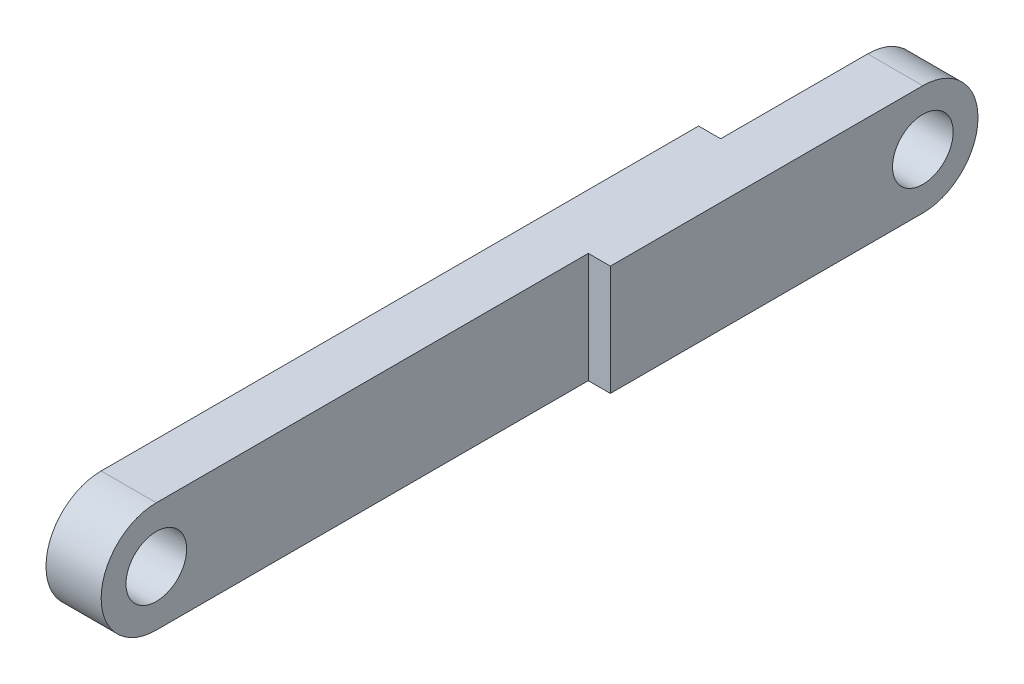
ISO-10303-21;
HEADER;
FILE_DESCRIPTION(('STEP AP214'),'2;1');
FILE_NAME('part.step','',(''),(''),'','','');
FILE_SCHEMA(('AUTOMOTIVE_DESIGN { 1 0 10303 214 1 1 1 1 }'));
ENDSEC;
DATA;
#1=APPLICATION_CONTEXT('core data for automotive mechanical design processes');
#2=APPLICATION_PROTOCOL_DEFINITION('international standard','automotive_design',2000,#1);
#3=PRODUCT_CONTEXT('',#1,'mechanical');
#4=PRODUCT('Part','Part','',(#3));
#5=PRODUCT_RELATED_PRODUCT_CATEGORY('part','',(#4));
#6=PRODUCT_DEFINITION_FORMATION('','',#4);
#7=PRODUCT_DEFINITION_CONTEXT('part definition',#1,'design');
#8=PRODUCT_DEFINITION('design','',#6,#7);
#9=PRODUCT_DEFINITION_SHAPE('','',#8);
#10=(LENGTH_UNIT() NAMED_UNIT(*) SI_UNIT(.MILLI.,.METRE.));
#11=(NAMED_UNIT(*) PLANE_ANGLE_UNIT() SI_UNIT($,.RADIAN.));
#12=(NAMED_UNIT(*) SI_UNIT($,.STERADIAN.) SOLID_ANGLE_UNIT());
#13=UNCERTAINTY_MEASURE_WITH_UNIT(LENGTH_MEASURE(1.E-05),#10,'distance_accuracy_value','');
#14=(GEOMETRIC_REPRESENTATION_CONTEXT(3) GLOBAL_UNCERTAINTY_ASSIGNED_CONTEXT((#13)) GLOBAL_UNIT_ASSIGNED_CONTEXT((#10,
#11,#12)) REPRESENTATION_CONTEXT('',''));
#15=CARTESIAN_POINT('',(0.,0.,0.));
#16=DIRECTION('',(0.,0.,1.));
#17=DIRECTION('',(1.,0.,0.));
#18=AXIS2_PLACEMENT_3D('',#15,#16,#17);
#19=CARTESIAN_POINT('',(3.,0.,0.));
#20=DIRECTION('',(1.,0.,0.));
#21=DIRECTION('',(0.,0.,-1.));
#22=AXIS2_PLACEMENT_3D('',#19,#20,#21);
#23=PLANE('',#22);
#24=DIRECTION('',(0.,-1.,0.));
#25=VECTOR('',#24,1.);
#26=CARTESIAN_POINT('',(3.,0.,-23.5));
#27=LINE('',#26,#25);
#28=CARTESIAN_POINT('',(3.,3.,-23.5));
#29=VERTEX_POINT('',#28);
#30=CARTESIAN_POINT('',(3.,-3.,-23.5));
#31=VERTEX_POINT('',#30);
#32=EDGE_CURVE('E66',#29,#31,#27,.T.);
#33=ORIENTED_EDGE('',*,*,#32,.F.);
#34=DIRECTION('',(0.,0.,1.));
#35=VECTOR('',#34,1.);
#36=CARTESIAN_POINT('',(3.,3.,0.));
#37=LINE('',#36,#35);
#38=CARTESIAN_POINT('',(3.,3.,0.));
#39=VERTEX_POINT('',#38);
#40=EDGE_CURVE('E144',#29,#39,#37,.T.);
#41=ORIENTED_EDGE('',*,*,#40,.T.);
#42=CARTESIAN_POINT('',(3.,0.,0.));
#43=DIRECTION('',(1.,0.,0.));
#44=DIRECTION('',(0.,0.,-1.));
#45=AXIS2_PLACEMENT_3D('',#42,#43,#44);
#46=CIRCLE('',#45,3.);
#47=CARTESIAN_POINT('',(3.,-3.,0.));
#48=VERTEX_POINT('',#47);
#49=EDGE_CURVE('E181',#39,#48,#46,.T.);
#50=ORIENTED_EDGE('',*,*,#49,.T.);
#51=DIRECTION('',(0.,0.,-1.));
#52=VECTOR('',#51,1.);
#53=CARTESIAN_POINT('',(3.,-3.,0.));
#54=LINE('',#53,#52);
#55=EDGE_CURVE('E185',#48,#31,#54,.T.);
#56=ORIENTED_EDGE('',*,*,#55,.T.);
#57=EDGE_LOOP('',(#33,#41,#50,#56));
#58=FACE_BOUND('',#57,.T.);
#59=CARTESIAN_POINT('',(3.,0.,0.));
#60=DIRECTION('',(1.,0.,0.));
#61=DIRECTION('',(0.,0.,-1.));
#62=AXIS2_PLACEMENT_3D('',#59,#60,#61);
#63=CIRCLE('',#62,1.65);
#64=CARTESIAN_POINT('',(3.,0.,-1.65));
#65=VERTEX_POINT('',#64);
#66=EDGE_CURVE('E173',#65,#65,#63,.T.);
#67=ORIENTED_EDGE('',*,*,#66,.F.);
#68=EDGE_LOOP('',(#67));
#69=FACE_BOUND('',#68,.T.);
#70=ADVANCED_FACE('F49',(#58,#69),#23,.T.);
#71=CARTESIAN_POINT('',(0.,0.,0.));
#72=DIRECTION('',(1.,0.,0.));
#73=DIRECTION('',(0.,0.,-1.));
#74=AXIS2_PLACEMENT_3D('',#71,#72,#73);
#75=PLANE('',#74);
#76=DIRECTION('',(0.,0.,1.));
#77=VECTOR('',#76,1.);
#78=CARTESIAN_POINT('',(0.,3.,0.));
#79=LINE('',#78,#77);
#80=CARTESIAN_POINT('',(0.,3.,-32.5));
#81=VERTEX_POINT('',#80);
#82=CARTESIAN_POINT('',(0.,3.,0.));
#83=VERTEX_POINT('',#82);
#84=EDGE_CURVE('E186',#81,#83,#79,.T.);
#85=ORIENTED_EDGE('',*,*,#84,.F.);
#86=DIRECTION('',(0.,1.,0.));
#87=VECTOR('',#86,1.);
#88=CARTESIAN_POINT('',(0.,3.,-32.5));
#89=LINE('',#88,#87);
#90=CARTESIAN_POINT('',(0.,-3.,-32.5));
#91=VERTEX_POINT('',#90);
#92=EDGE_CURVE('E146',#91,#81,#89,.T.);
#93=ORIENTED_EDGE('',*,*,#92,.F.);
#94=DIRECTION('',(0.,0.,-1.));
#95=VECTOR('',#94,1.);
#96=CARTESIAN_POINT('',(0.,-3.,0.));
#97=LINE('',#96,#95);
#98=CARTESIAN_POINT('',(0.,-3.,0.));
#99=VERTEX_POINT('',#98);
#100=EDGE_CURVE('E195',#99,#91,#97,.T.);
#101=ORIENTED_EDGE('',*,*,#100,.F.);
#102=CARTESIAN_POINT('',(0.,0.,0.));
#103=DIRECTION('',(1.,0.,0.));
#104=DIRECTION('',(0.,0.,-1.));
#105=AXIS2_PLACEMENT_3D('',#102,#103,#104);
#106=CIRCLE('',#105,3.);
#107=EDGE_CURVE('E177',#83,#99,#106,.T.);
#108=ORIENTED_EDGE('',*,*,#107,.F.);
#109=EDGE_LOOP('',(#85,#93,#101,#108));
#110=FACE_BOUND('',#109,.T.);
#111=CARTESIAN_POINT('',(0.,0.,0.));
#112=DIRECTION('',(1.,0.,0.));
#113=DIRECTION('',(0.,0.,-1.));
#114=AXIS2_PLACEMENT_3D('',#111,#112,#113);
#115=CIRCLE('',#114,1.65);
#116=CARTESIAN_POINT('',(0.,0.,-1.65));
#117=VERTEX_POINT('',#116);
#118=EDGE_CURVE('E172',#117,#117,#115,.T.);
#119=ORIENTED_EDGE('',*,*,#118,.T.);
#120=EDGE_LOOP('',(#119));
#121=FACE_BOUND('',#120,.T.);
#122=ADVANCED_FACE('F243',(#110,#121),#75,.F.);
#123=CARTESIAN_POINT('',(3.,0.,0.));
#124=DIRECTION('',(-1.,0.,0.));
#125=DIRECTION('',(0.,0.,1.));
#126=AXIS2_PLACEMENT_3D('',#123,#124,#125);
#127=CYLINDRICAL_SURFACE('',#126,3.);
#128=ORIENTED_EDGE('',*,*,#107,.T.);
#129=DIRECTION('',(-1.,0.,0.));
#130=VECTOR('',#129,1.);
#131=CARTESIAN_POINT('',(3.,-3.,0.));
#132=LINE('',#131,#130);
#133=EDGE_CURVE('E11',#48,#99,#132,.T.);
#134=ORIENTED_EDGE('',*,*,#133,.F.);
#135=ORIENTED_EDGE('',*,*,#49,.F.);
#136=DIRECTION('',(-1.,0.,0.));
#137=VECTOR('',#136,1.);
#138=CARTESIAN_POINT('',(3.,3.,0.));
#139=LINE('',#138,#137);
#140=EDGE_CURVE('E191',#39,#83,#139,.T.);
#141=ORIENTED_EDGE('',*,*,#140,.T.);
#142=EDGE_LOOP('',(#128,#134,#135,#141));
#143=FACE_BOUND('',#142,.T.);
#144=ADVANCED_FACE('F51',(#143),#127,.T.);
#145=CARTESIAN_POINT('',(3.,-3.,0.));
#146=DIRECTION('',(0.,1.,0.));
#147=DIRECTION('',(0.,0.,1.));
#148=AXIS2_PLACEMENT_3D('',#145,#146,#147);
#149=PLANE('',#148);
#150=ORIENTED_EDGE('',*,*,#100,.T.);
#151=DIRECTION('',(-1.,0.,0.));
#152=VECTOR('',#151,1.);
#153=CARTESIAN_POINT('',(1.2,-3.,-32.5));
#154=LINE('',#153,#152);
#155=CARTESIAN_POINT('',(1.2,-3.,-32.5));
#156=VERTEX_POINT('',#155);
#157=EDGE_CURVE('E161',#156,#91,#154,.T.);
#158=ORIENTED_EDGE('',*,*,#157,.F.);
#159=DIRECTION('',(0.,0.,1.));
#160=VECTOR('',#159,1.);
#161=CARTESIAN_POINT('',(1.2,-3.,-32.5));
#162=LINE('',#161,#160);
#163=CARTESIAN_POINT('',(1.2,-3.,-40.5));
#164=VERTEX_POINT('',#163);
#165=EDGE_CURVE('E150',#164,#156,#162,.T.);
#166=ORIENTED_EDGE('',*,*,#165,.F.);
#167=DIRECTION('',(-1.,0.,0.));
#168=VECTOR('',#167,1.);
#169=CARTESIAN_POINT('',(3.,-3.,-40.5));
#170=LINE('',#169,#168);
#171=CARTESIAN_POINT('',(4.2,-3.,-40.5));
#172=VERTEX_POINT('',#171);
#173=EDGE_CURVE('E59',#172,#164,#170,.T.);
#174=ORIENTED_EDGE('',*,*,#173,.F.);
#175=DIRECTION('',(0.,0.,-1.));
#176=VECTOR('',#175,1.);
#177=CARTESIAN_POINT('',(4.2,-3.,0.));
#178=LINE('',#177,#176);
#179=CARTESIAN_POINT('',(4.2,-3.,-23.5));
#180=VERTEX_POINT('',#179);
#181=EDGE_CURVE('E128',#180,#172,#178,.T.);
#182=ORIENTED_EDGE('',*,*,#181,.F.);
#183=DIRECTION('',(-1.,0.,0.));
#184=VECTOR('',#183,1.);
#185=CARTESIAN_POINT('',(4.2,-3.,-23.5));
#186=LINE('',#185,#184);
#187=EDGE_CURVE('E123',#180,#31,#186,.T.);
#188=ORIENTED_EDGE('',*,*,#187,.T.);
#189=ORIENTED_EDGE('',*,*,#55,.F.);
#190=ORIENTED_EDGE('',*,*,#133,.T.);
#191=EDGE_LOOP('',(#150,#158,#166,#174,#182,#188,#189,#190));
#192=FACE_BOUND('',#191,.T.);
#193=ADVANCED_FACE('F213',(#192),#149,.F.);
#194=CARTESIAN_POINT('',(3.,0.,-40.5));
#195=DIRECTION('',(-1.,0.,0.));
#196=DIRECTION('',(0.,0.,1.));
#197=AXIS2_PLACEMENT_3D('',#194,#195,#196);
#198=CYLINDRICAL_SURFACE('',#197,3.);
#199=CARTESIAN_POINT('',(1.2,0.,-40.5));
#200=DIRECTION('',(1.,0.,0.));
#201=DIRECTION('',(0.,0.,-1.));
#202=AXIS2_PLACEMENT_3D('',#199,#200,#201);
#203=CIRCLE('',#202,3.);
#204=CARTESIAN_POINT('',(1.2,3.,-40.5));
#205=VERTEX_POINT('',#204);
#206=EDGE_CURVE('E169',#164,#205,#203,.T.);
#207=ORIENTED_EDGE('',*,*,#206,.T.);
#208=DIRECTION('',(-1.,0.,0.));
#209=VECTOR('',#208,1.);
#210=CARTESIAN_POINT('',(3.,3.,-40.5));
#211=LINE('',#210,#209);
#212=CARTESIAN_POINT('',(4.2,3.,-40.5));
#213=VERTEX_POINT('',#212);
#214=EDGE_CURVE('E204',#213,#205,#211,.T.);
#215=ORIENTED_EDGE('',*,*,#214,.F.);
#216=CARTESIAN_POINT('',(4.2,0.,-40.5));
#217=DIRECTION('',(1.,0.,0.));
#218=DIRECTION('',(0.,0.,-1.));
#219=AXIS2_PLACEMENT_3D('',#216,#217,#218);
#220=CIRCLE('',#219,3.);
#221=EDGE_CURVE('E135',#172,#213,#220,.T.);
#222=ORIENTED_EDGE('',*,*,#221,.F.);
#223=ORIENTED_EDGE('',*,*,#173,.T.);
#224=EDGE_LOOP('',(#207,#215,#222,#223));
#225=FACE_BOUND('',#224,.T.);
#226=ADVANCED_FACE('F210',(#225),#198,.T.);
#227=CARTESIAN_POINT('',(3.,3.,0.));
#228=DIRECTION('',(0.,-1.,0.));
#229=DIRECTION('',(0.,0.,-1.));
#230=AXIS2_PLACEMENT_3D('',#227,#228,#229);
#231=PLANE('',#230);
#232=DIRECTION('',(0.,0.,-1.));
#233=VECTOR('',#232,1.);
#234=CARTESIAN_POINT('',(1.2,3.,-43.5));
#235=LINE('',#234,#233);
#236=CARTESIAN_POINT('',(1.2,3.,-32.5));
#237=VERTEX_POINT('',#236);
#238=EDGE_CURVE('E159',#237,#205,#235,.T.);
#239=ORIENTED_EDGE('',*,*,#238,.F.);
#240=DIRECTION('',(-1.,0.,0.));
#241=VECTOR('',#240,1.);
#242=CARTESIAN_POINT('',(1.2,3.,-32.5));
#243=LINE('',#242,#241);
#244=EDGE_CURVE('E163',#237,#81,#243,.T.);
#245=ORIENTED_EDGE('',*,*,#244,.T.);
#246=ORIENTED_EDGE('',*,*,#84,.T.);
#247=ORIENTED_EDGE('',*,*,#140,.F.);
#248=ORIENTED_EDGE('',*,*,#40,.F.);
#249=DIRECTION('',(-1.,0.,0.));
#250=VECTOR('',#249,1.);
#251=CARTESIAN_POINT('',(4.2,3.,-23.5));
#252=LINE('',#251,#250);
#253=CARTESIAN_POINT('',(4.2,3.,-23.5));
#254=VERTEX_POINT('',#253);
#255=EDGE_CURVE('E121',#254,#29,#252,.T.);
#256=ORIENTED_EDGE('',*,*,#255,.F.);
#257=DIRECTION('',(0.,0.,1.));
#258=VECTOR('',#257,1.);
#259=CARTESIAN_POINT('',(4.2,3.,0.));
#260=LINE('',#259,#258);
#261=EDGE_CURVE('E129',#213,#254,#260,.T.);
#262=ORIENTED_EDGE('',*,*,#261,.F.);
#263=ORIENTED_EDGE('',*,*,#214,.T.);
#264=EDGE_LOOP('',(#239,#245,#246,#247,#248,#256,#262,#263));
#265=FACE_BOUND('',#264,.T.);
#266=ADVANCED_FACE('F142',(#265),#231,.F.);
#267=CARTESIAN_POINT('',(3.,0.,-40.5));
#268=DIRECTION('',(-1.,0.,0.));
#269=DIRECTION('',(0.,0.,1.));
#270=AXIS2_PLACEMENT_3D('',#267,#268,#269);
#271=CYLINDRICAL_SURFACE('',#270,1.65);
#272=CARTESIAN_POINT('',(1.2,0.,-40.5));
#273=DIRECTION('',(1.,0.,0.));
#274=DIRECTION('',(0.,0.,-1.));
#275=AXIS2_PLACEMENT_3D('',#272,#273,#274);
#276=CIRCLE('',#275,1.65);
#277=CARTESIAN_POINT('',(1.2,0.,-42.15));
#278=VERTEX_POINT('',#277);
#279=EDGE_CURVE('E53',#278,#278,#276,.T.);
#280=ORIENTED_EDGE('',*,*,#279,.F.);
#281=EDGE_LOOP('',(#280));
#282=FACE_BOUND('',#281,.T.);
#283=CARTESIAN_POINT('',(4.2,0.,-40.5));
#284=DIRECTION('',(1.,0.,0.));
#285=DIRECTION('',(0.,0.,-1.));
#286=AXIS2_PLACEMENT_3D('',#283,#284,#285);
#287=CIRCLE('',#286,1.65);
#288=CARTESIAN_POINT('',(4.2,0.,-42.15));
#289=VERTEX_POINT('',#288);
#290=EDGE_CURVE('E139',#289,#289,#287,.F.);
#291=ORIENTED_EDGE('',*,*,#290,.F.);
#292=EDGE_LOOP('',(#291));
#293=FACE_BOUND('',#292,.T.);
#294=ADVANCED_FACE('F226',(#282,#293),#271,.F.);
#295=CARTESIAN_POINT('',(3.,0.,0.));
#296=DIRECTION('',(-1.,0.,0.));
#297=DIRECTION('',(0.,0.,1.));
#298=AXIS2_PLACEMENT_3D('',#295,#296,#297);
#299=CYLINDRICAL_SURFACE('',#298,1.65);
#300=ORIENTED_EDGE('',*,*,#66,.T.);
#301=EDGE_LOOP('',(#300));
#302=FACE_BOUND('',#301,.T.);
#303=ORIENTED_EDGE('',*,*,#118,.F.);
#304=EDGE_LOOP('',(#303));
#305=FACE_BOUND('',#304,.T.);
#306=ADVANCED_FACE('F228',(#302,#305),#299,.F.);
#307=CARTESIAN_POINT('',(1.2,0.,0.));
#308=DIRECTION('',(1.,0.,0.));
#309=DIRECTION('',(0.,0.,-1.));
#310=AXIS2_PLACEMENT_3D('',#307,#308,#309);
#311=PLANE('',#310);
#312=ORIENTED_EDGE('',*,*,#279,.T.);
#313=EDGE_LOOP('',(#312));
#314=FACE_BOUND('',#313,.T.);
#315=ORIENTED_EDGE('',*,*,#206,.F.);
#316=ORIENTED_EDGE('',*,*,#165,.T.);
#317=DIRECTION('',(0.,1.,0.));
#318=VECTOR('',#317,1.);
#319=CARTESIAN_POINT('',(1.2,3.,-32.5));
#320=LINE('',#319,#318);
#321=EDGE_CURVE('E74',#156,#237,#320,.T.);
#322=ORIENTED_EDGE('',*,*,#321,.T.);
#323=ORIENTED_EDGE('',*,*,#238,.T.);
#324=EDGE_LOOP('',(#315,#316,#322,#323));
#325=FACE_BOUND('',#324,.T.);
#326=ADVANCED_FACE('F236',(#314,#325),#311,.F.);
#327=CARTESIAN_POINT('',(1.2,3.,-32.5));
#328=DIRECTION('',(0.,0.,1.));
#329=DIRECTION('',(1.,0.,0.));
#330=AXIS2_PLACEMENT_3D('',#327,#328,#329);
#331=PLANE('',#330);
#332=ORIENTED_EDGE('',*,*,#92,.T.);
#333=ORIENTED_EDGE('',*,*,#244,.F.);
#334=ORIENTED_EDGE('',*,*,#321,.F.);
#335=ORIENTED_EDGE('',*,*,#157,.T.);
#336=EDGE_LOOP('',(#332,#333,#334,#335));
#337=FACE_BOUND('',#336,.T.);
#338=ADVANCED_FACE('F267',(#337),#331,.F.);
#339=CARTESIAN_POINT('',(4.2,0.,-23.5));
#340=DIRECTION('',(0.,0.,-1.));
#341=DIRECTION('',(-1.,0.,0.));
#342=AXIS2_PLACEMENT_3D('',#339,#340,#341);
#343=PLANE('',#342);
#344=ORIENTED_EDGE('',*,*,#32,.T.);
#345=ORIENTED_EDGE('',*,*,#187,.F.);
#346=DIRECTION('',(0.,-1.,0.));
#347=VECTOR('',#346,1.);
#348=CARTESIAN_POINT('',(4.2,0.,-23.5));
#349=LINE('',#348,#347);
#350=EDGE_CURVE('E117',#254,#180,#349,.T.);
#351=ORIENTED_EDGE('',*,*,#350,.F.);
#352=ORIENTED_EDGE('',*,*,#255,.T.);
#353=EDGE_LOOP('',(#344,#345,#351,#352));
#354=FACE_BOUND('',#353,.T.);
#355=ADVANCED_FACE('F119',(#354),#343,.F.);
#356=CARTESIAN_POINT('',(4.2,0.,0.));
#357=DIRECTION('',(1.,0.,0.));
#358=DIRECTION('',(0.,0.,-1.));
#359=AXIS2_PLACEMENT_3D('',#356,#357,#358);
#360=PLANE('',#359);
#361=ORIENTED_EDGE('',*,*,#290,.T.);
#362=EDGE_LOOP('',(#361));
#363=FACE_BOUND('',#362,.T.);
#364=ORIENTED_EDGE('',*,*,#261,.T.);
#365=ORIENTED_EDGE('',*,*,#350,.T.);
#366=ORIENTED_EDGE('',*,*,#181,.T.);
#367=ORIENTED_EDGE('',*,*,#221,.T.);
#368=EDGE_LOOP('',(#364,#365,#366,#367));
#369=FACE_BOUND('',#368,.T.);
#370=ADVANCED_FACE('F133',(#363,#369),#360,.T.);
#371=CLOSED_SHELL('',(#70,#122,#144,#193,#226,#266,#294,#306,#326,#338,#355,#370));
#372=MANIFOLD_SOLID_BREP('B2',#371);
#373=ADVANCED_BREP_SHAPE_REPRESENTATION('',(#18,#372),#14);
#374=SHAPE_DEFINITION_REPRESENTATION(#9,#373);
ENDSEC;
END-ISO-10303-21;
